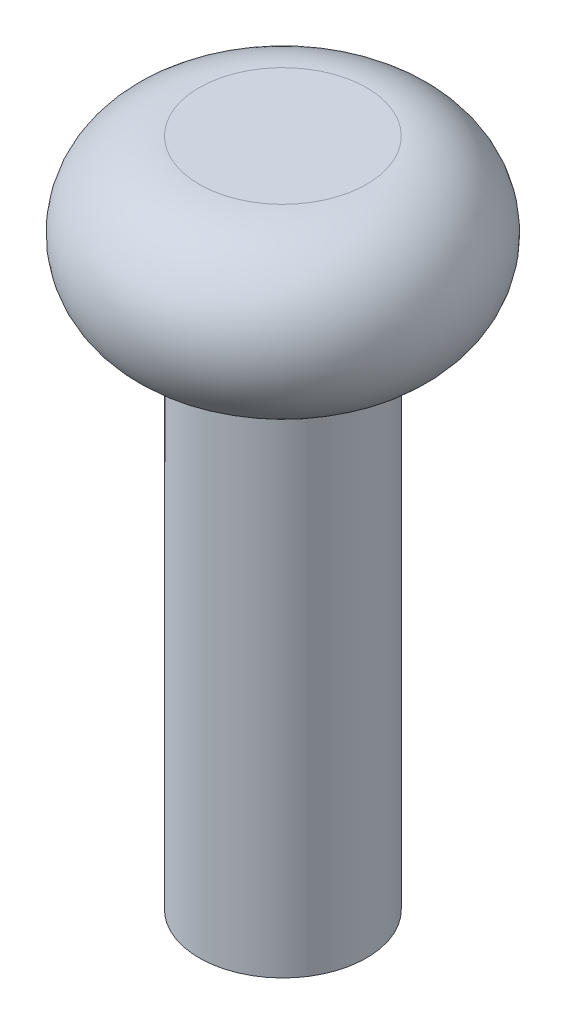
ISO-10303-21;
HEADER;
FILE_DESCRIPTION(('STEP AP214'),'2;1');
FILE_NAME('part.step','',(''),(''),'','','');
FILE_SCHEMA(('AUTOMOTIVE_DESIGN { 1 0 10303 214 1 1 1 1 }'));
ENDSEC;
DATA;
#1=APPLICATION_CONTEXT('core data for automotive mechanical design processes');
#2=APPLICATION_PROTOCOL_DEFINITION('international standard','automotive_design',2000,#1);
#3=PRODUCT_CONTEXT('',#1,'mechanical');
#4=PRODUCT('Part','Part','',(#3));
#5=PRODUCT_RELATED_PRODUCT_CATEGORY('part','',(#4));
#6=PRODUCT_DEFINITION_FORMATION('','',#4);
#7=PRODUCT_DEFINITION_CONTEXT('part definition',#1,'design');
#8=PRODUCT_DEFINITION('design','',#6,#7);
#9=PRODUCT_DEFINITION_SHAPE('','',#8);
#10=(LENGTH_UNIT() NAMED_UNIT(*) SI_UNIT(.MILLI.,.METRE.));
#11=(NAMED_UNIT(*) PLANE_ANGLE_UNIT() SI_UNIT($,.RADIAN.));
#12=(NAMED_UNIT(*) SI_UNIT($,.STERADIAN.) SOLID_ANGLE_UNIT());
#13=UNCERTAINTY_MEASURE_WITH_UNIT(LENGTH_MEASURE(1.E-05),#10,'distance_accuracy_value','');
#14=(GEOMETRIC_REPRESENTATION_CONTEXT(3) GLOBAL_UNCERTAINTY_ASSIGNED_CONTEXT((#13)) GLOBAL_UNIT_ASSIGNED_CONTEXT((#10,
#11,#12)) REPRESENTATION_CONTEXT('',''));
#15=CARTESIAN_POINT('',(0.,0.,0.));
#16=DIRECTION('',(0.,0.,1.));
#17=DIRECTION('',(1.,0.,0.));
#18=AXIS2_PLACEMENT_3D('',#15,#16,#17);
#19=CARTESIAN_POINT('',(0.,-30.,0.));
#20=DIRECTION('',(0.,1.,0.));
#21=DIRECTION('',(-1.,0.,0.));
#22=AXIS2_PLACEMENT_3D('',#19,#20,#21);
#23=PLANE('',#22);
#24=CARTESIAN_POINT('',(0.,-30.,0.));
#25=DIRECTION('',(0.,1.,0.));
#26=DIRECTION('',(-1.,0.,0.));
#27=AXIS2_PLACEMENT_3D('',#24,#25,#26);
#28=CIRCLE('',#27,5.);
#29=CARTESIAN_POINT('',(-5.,-30.,0.));
#30=VERTEX_POINT('',#29);
#31=EDGE_CURVE('E10',#30,#30,#28,.T.);
#32=ORIENTED_EDGE('',*,*,#31,.F.);
#33=EDGE_LOOP('',(#32));
#34=FACE_BOUND('',#33,.T.);
#35=ADVANCED_FACE('F31',(#34),#23,.F.);
#36=CARTESIAN_POINT('',(0.,0.,0.));
#37=DIRECTION('',(0.,1.,0.));
#38=DIRECTION('',(-1.,0.,0.));
#39=AXIS2_PLACEMENT_3D('',#36,#37,#38);
#40=CYLINDRICAL_SURFACE('',#39,5.);
#41=CARTESIAN_POINT('',(0.,0.,0.));
#42=DIRECTION('',(0.,1.,0.));
#43=DIRECTION('',(-1.,0.,0.));
#44=AXIS2_PLACEMENT_3D('',#41,#42,#43);
#45=CIRCLE('',#44,5.);
#46=CARTESIAN_POINT('',(-5.,0.,0.));
#47=VERTEX_POINT('',#46);
#48=EDGE_CURVE('E37',#47,#47,#45,.T.);
#49=ORIENTED_EDGE('',*,*,#48,.F.);
#50=EDGE_LOOP('',(#49));
#51=FACE_BOUND('',#50,.T.);
#52=ORIENTED_EDGE('',*,*,#31,.T.);
#53=EDGE_LOOP('',(#52));
#54=FACE_BOUND('',#53,.T.);
#55=ADVANCED_FACE('F52',(#51,#54),#40,.T.);
#56=CARTESIAN_POINT('',(0.,5.,0.));
#57=DIRECTION('',(0.,1.,0.));
#58=DIRECTION('',(-1.,0.,0.));
#59=AXIS2_PLACEMENT_3D('',#56,#57,#58);
#60=TOROIDAL_SURFACE('',#59,5.,5.);
#61=CARTESIAN_POINT('',(0.,10.,0.));
#62=DIRECTION('',(0.,1.,0.));
#63=DIRECTION('',(-1.,0.,0.));
#64=AXIS2_PLACEMENT_3D('',#61,#62,#63);
#65=CIRCLE('',#64,5.);
#66=CARTESIAN_POINT('',(-5.,10.,0.));
#67=VERTEX_POINT('',#66);
#68=EDGE_CURVE('E41',#67,#67,#65,.T.);
#69=ORIENTED_EDGE('',*,*,#68,.F.);
#70=EDGE_LOOP('',(#69));
#71=FACE_BOUND('',#70,.T.);
#72=ORIENTED_EDGE('',*,*,#48,.T.);
#73=EDGE_LOOP('',(#72));
#74=FACE_BOUND('',#73,.T.);
#75=ADVANCED_FACE('F50',(#71,#74),#60,.T.);
#76=CARTESIAN_POINT('',(5.,10.,0.));
#77=DIRECTION('',(0.,-1.,0.));
#78=DIRECTION('',(1.,0.,0.));
#79=AXIS2_PLACEMENT_3D('',#76,#77,#78);
#80=PLANE('',#79);
#81=ORIENTED_EDGE('',*,*,#68,.T.);
#82=EDGE_LOOP('',(#81));
#83=FACE_BOUND('',#82,.T.);
#84=ADVANCED_FACE('F48',(#83),#80,.F.);
#85=CLOSED_SHELL('',(#35,#55,#75,#84));
#86=MANIFOLD_SOLID_BREP('B2',#85);
#87=ADVANCED_BREP_SHAPE_REPRESENTATION('',(#18,#86),#14);
#88=SHAPE_DEFINITION_REPRESENTATION(#9,#87);
ENDSEC;
END-ISO-10303-21;
